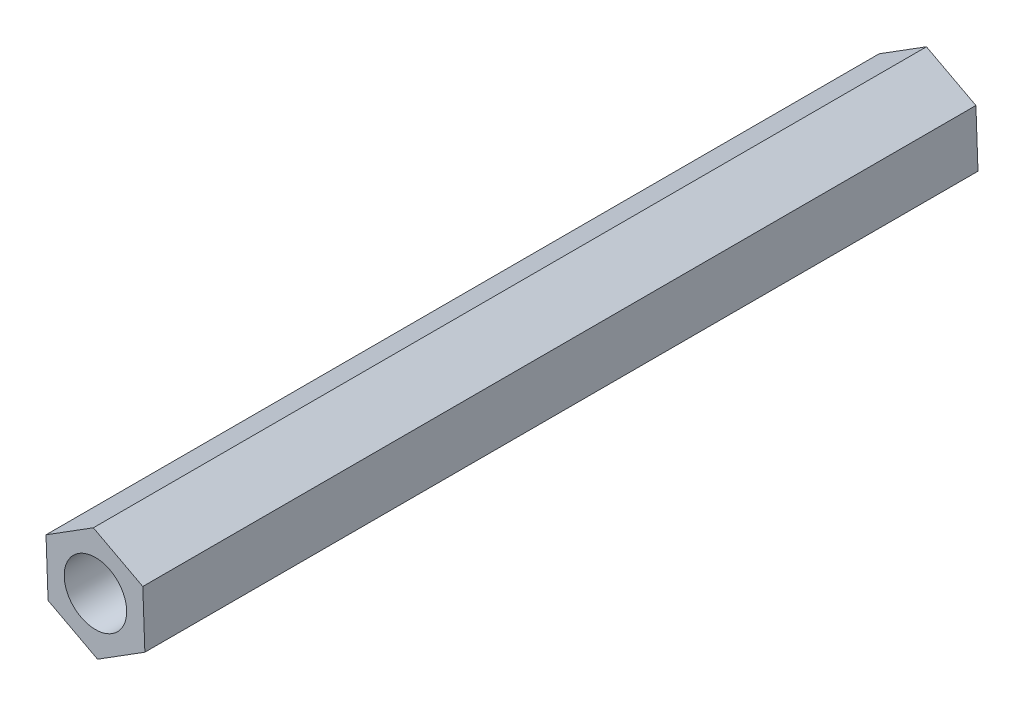
ISO-10303-21;
HEADER;
FILE_DESCRIPTION(('STEP AP214'),'2;1');
FILE_NAME('part.step','',(''),(''),'','','');
FILE_SCHEMA(('AUTOMOTIVE_DESIGN { 1 0 10303 214 1 1 1 1 }'));
ENDSEC;
DATA;
#1=APPLICATION_CONTEXT('core data for automotive mechanical design processes');
#2=APPLICATION_PROTOCOL_DEFINITION('international standard','automotive_design',2000,#1);
#3=PRODUCT_CONTEXT('',#1,'mechanical');
#4=PRODUCT('Part','Part','',(#3));
#5=PRODUCT_RELATED_PRODUCT_CATEGORY('part','',(#4));
#6=PRODUCT_DEFINITION_FORMATION('','',#4);
#7=PRODUCT_DEFINITION_CONTEXT('part definition',#1,'design');
#8=PRODUCT_DEFINITION('design','',#6,#7);
#9=PRODUCT_DEFINITION_SHAPE('','',#8);
#10=(LENGTH_UNIT() NAMED_UNIT(*) SI_UNIT(.MILLI.,.METRE.));
#11=(NAMED_UNIT(*) PLANE_ANGLE_UNIT() SI_UNIT($,.RADIAN.));
#12=(NAMED_UNIT(*) SI_UNIT($,.STERADIAN.) SOLID_ANGLE_UNIT());
#13=UNCERTAINTY_MEASURE_WITH_UNIT(LENGTH_MEASURE(1.E-05),#10,'distance_accuracy_value','');
#14=(GEOMETRIC_REPRESENTATION_CONTEXT(3) GLOBAL_UNCERTAINTY_ASSIGNED_CONTEXT((#13)) GLOBAL_UNIT_ASSIGNED_CONTEXT((#10,
#11,#12)) REPRESENTATION_CONTEXT('',''));
#15=CARTESIAN_POINT('',(0.,0.,0.));
#16=DIRECTION('',(0.,0.,1.));
#17=DIRECTION('',(1.,0.,0.));
#18=AXIS2_PLACEMENT_3D('',#15,#16,#17);
#19=CARTESIAN_POINT('',(0.,0.,40.));
#20=DIRECTION('',(0.,0.,1.));
#21=DIRECTION('',(1.,0.,0.));
#22=AXIS2_PLACEMENT_3D('',#19,#20,#21);
#23=PLANE('',#22);
#24=DIRECTION('',(-0.0373746720524852,0.999301322869618,0.));
#25=VECTOR('',#24,1.);
#26=CARTESIAN_POINT('',(2.37354506962798,-1.25450540152072,40.));
#27=LINE('',#26,#25);
#28=CARTESIAN_POINT('',(2.37354506962798,-1.25450540152072,40.));
#29=VERTEX_POINT('',#28);
#30=CARTESIAN_POINT('',(2.27320608171573,1.42829762656477,40.));
#31=VERTEX_POINT('',#30);
#32=EDGE_CURVE('E131',#29,#31,#27,.T.);
#33=ORIENTED_EDGE('',*,*,#32,.T.);
#34=DIRECTION('',(-0.884107667666727,0.467283245979245,0.));
#35=VECTOR('',#34,1.);
#36=CARTESIAN_POINT('',(2.27320608171573,1.42829762656477,40.));
#37=LINE('',#36,#35);
#38=CARTESIAN_POINT('',(-0.100338987912251,2.68280302808549,40.));
#39=VERTEX_POINT('',#38);
#40=EDGE_CURVE('E89',#31,#39,#37,.T.);
#41=ORIENTED_EDGE('',*,*,#40,.T.);
#42=DIRECTION('',(-0.846732995614242,-0.532018076890375,0.));
#43=VECTOR('',#42,1.);
#44=CARTESIAN_POINT('',(-0.100338987912251,2.68280302808549,40.));
#45=LINE('',#44,#43);
#46=CARTESIAN_POINT('',(-2.37354506962798,1.25450540152072,40.));
#47=VERTEX_POINT('',#46);
#48=EDGE_CURVE('E102',#39,#47,#45,.T.);
#49=ORIENTED_EDGE('',*,*,#48,.T.);
#50=DIRECTION('',(0.0373746720524864,-0.999301322869618,0.));
#51=VECTOR('',#50,1.);
#52=CARTESIAN_POINT('',(-2.37354506962798,1.25450540152072,40.));
#53=LINE('',#52,#51);
#54=CARTESIAN_POINT('',(-2.27320608171573,-1.42829762656478,40.));
#55=VERTEX_POINT('',#54);
#56=EDGE_CURVE('E96',#47,#55,#53,.T.);
#57=ORIENTED_EDGE('',*,*,#56,.T.);
#58=DIRECTION('',(0.884107667666728,-0.467283245979244,0.));
#59=VECTOR('',#58,1.);
#60=CARTESIAN_POINT('',(-2.27320608171573,-1.42829762656478,40.));
#61=LINE('',#60,#59);
#62=CARTESIAN_POINT('',(0.100338987912251,-2.68280302808549,40.));
#63=VERTEX_POINT('',#62);
#64=EDGE_CURVE('E100',#55,#63,#61,.T.);
#65=ORIENTED_EDGE('',*,*,#64,.T.);
#66=DIRECTION('',(0.846732995614242,0.532018076890374,0.));
#67=VECTOR('',#66,1.);
#68=CARTESIAN_POINT('',(0.100338987912251,-2.68280302808549,40.));
#69=LINE('',#68,#67);
#70=EDGE_CURVE('E52',#63,#29,#69,.T.);
#71=ORIENTED_EDGE('',*,*,#70,.T.);
#72=EDGE_LOOP('',(#33,#41,#49,#57,#65,#71));
#73=FACE_BOUND('',#72,.T.);
#74=CARTESIAN_POINT('',(0.,0.,40.));
#75=DIRECTION('',(0.,0.,1.));
#76=DIRECTION('',(1.,0.,0.));
#77=AXIS2_PLACEMENT_3D('',#74,#75,#76);
#78=CIRCLE('',#77,1.5);
#79=CARTESIAN_POINT('',(1.5,0.,40.));
#80=VERTEX_POINT('',#79);
#81=EDGE_CURVE('E124',#80,#80,#78,.T.);
#82=ORIENTED_EDGE('',*,*,#81,.F.);
#83=EDGE_LOOP('',(#82));
#84=FACE_BOUND('',#83,.T.);
#85=ADVANCED_FACE('F35',(#73,#84),#23,.T.);
#86=CARTESIAN_POINT('',(0.,0.,0.));
#87=DIRECTION('',(0.,0.,1.));
#88=DIRECTION('',(1.,0.,0.));
#89=AXIS2_PLACEMENT_3D('',#86,#87,#88);
#90=PLANE('',#89);
#91=DIRECTION('',(-0.0373746720524852,0.999301322869618,0.));
#92=VECTOR('',#91,1.);
#93=CARTESIAN_POINT('',(2.37354506962798,-1.25450540152072,0.));
#94=LINE('',#93,#92);
#95=CARTESIAN_POINT('',(2.37354506962798,-1.25450540152072,0.));
#96=VERTEX_POINT('',#95);
#97=CARTESIAN_POINT('',(2.27320608171573,1.42829762656477,0.));
#98=VERTEX_POINT('',#97);
#99=EDGE_CURVE('E120',#96,#98,#94,.T.);
#100=ORIENTED_EDGE('',*,*,#99,.F.);
#101=DIRECTION('',(0.846732995614242,0.532018076890374,0.));
#102=VECTOR('',#101,1.);
#103=CARTESIAN_POINT('',(0.100338987912251,-2.68280302808549,0.));
#104=LINE('',#103,#102);
#105=CARTESIAN_POINT('',(0.100338987912251,-2.68280302808549,0.));
#106=VERTEX_POINT('',#105);
#107=EDGE_CURVE('E81',#106,#96,#104,.T.);
#108=ORIENTED_EDGE('',*,*,#107,.F.);
#109=DIRECTION('',(0.884107667666728,-0.467283245979244,0.));
#110=VECTOR('',#109,1.);
#111=CARTESIAN_POINT('',(-2.27320608171573,-1.42829762656478,0.));
#112=LINE('',#111,#110);
#113=CARTESIAN_POINT('',(-2.27320608171573,-1.42829762656478,0.));
#114=VERTEX_POINT('',#113);
#115=EDGE_CURVE('E75',#114,#106,#112,.T.);
#116=ORIENTED_EDGE('',*,*,#115,.F.);
#117=DIRECTION('',(0.0373746720524864,-0.999301322869618,0.));
#118=VECTOR('',#117,1.);
#119=CARTESIAN_POINT('',(-2.37354506962798,1.25450540152072,0.));
#120=LINE('',#119,#118);
#121=CARTESIAN_POINT('',(-2.37354506962798,1.25450540152072,0.));
#122=VERTEX_POINT('',#121);
#123=EDGE_CURVE('E110',#122,#114,#120,.T.);
#124=ORIENTED_EDGE('',*,*,#123,.F.);
#125=DIRECTION('',(-0.846732995614242,-0.532018076890375,0.));
#126=VECTOR('',#125,1.);
#127=CARTESIAN_POINT('',(-0.100338987912251,2.68280302808549,0.));
#128=LINE('',#127,#126);
#129=CARTESIAN_POINT('',(-0.100338987912251,2.68280302808549,0.));
#130=VERTEX_POINT('',#129);
#131=EDGE_CURVE('E126',#130,#122,#128,.T.);
#132=ORIENTED_EDGE('',*,*,#131,.F.);
#133=DIRECTION('',(-0.884107667666727,0.467283245979245,0.));
#134=VECTOR('',#133,1.);
#135=CARTESIAN_POINT('',(2.27320608171573,1.42829762656477,0.));
#136=LINE('',#135,#134);
#137=EDGE_CURVE('E123',#98,#130,#136,.T.);
#138=ORIENTED_EDGE('',*,*,#137,.F.);
#139=EDGE_LOOP('',(#100,#108,#116,#124,#132,#138));
#140=FACE_BOUND('',#139,.T.);
#141=CARTESIAN_POINT('',(0.,0.,0.));
#142=DIRECTION('',(0.,0.,1.));
#143=DIRECTION('',(1.,0.,0.));
#144=AXIS2_PLACEMENT_3D('',#141,#142,#143);
#145=CIRCLE('',#144,1.5);
#146=CARTESIAN_POINT('',(1.5,0.,0.));
#147=VERTEX_POINT('',#146);
#148=EDGE_CURVE('E224',#147,#147,#145,.T.);
#149=ORIENTED_EDGE('',*,*,#148,.T.);
#150=EDGE_LOOP('',(#149));
#151=FACE_BOUND('',#150,.T.);
#152=ADVANCED_FACE('F140',(#140,#151),#90,.F.);
#153=CARTESIAN_POINT('',(2.37354506962798,-1.25450540152072,40.));
#154=DIRECTION('',(-0.999301322869618,-0.0373746720524852,0.));
#155=DIRECTION('',(0.0373746720524852,-0.999301322869618,0.));
#156=AXIS2_PLACEMENT_3D('',#153,#154,#155);
#157=PLANE('',#156);
#158=ORIENTED_EDGE('',*,*,#99,.T.);
#159=DIRECTION('',(0.,0.,-1.));
#160=VECTOR('',#159,1.);
#161=CARTESIAN_POINT('',(2.27320608171573,1.42829762656477,40.));
#162=LINE('',#161,#160);
#163=EDGE_CURVE('E11',#31,#98,#162,.T.);
#164=ORIENTED_EDGE('',*,*,#163,.F.);
#165=ORIENTED_EDGE('',*,*,#32,.F.);
#166=DIRECTION('',(0.,0.,-1.));
#167=VECTOR('',#166,1.);
#168=CARTESIAN_POINT('',(2.37354506962798,-1.25450540152072,40.));
#169=LINE('',#168,#167);
#170=EDGE_CURVE('E116',#29,#96,#169,.T.);
#171=ORIENTED_EDGE('',*,*,#170,.T.);
#172=EDGE_LOOP('',(#158,#164,#165,#171));
#173=FACE_BOUND('',#172,.T.);
#174=ADVANCED_FACE('F37',(#173),#157,.F.);
#175=CARTESIAN_POINT('',(2.27320608171573,1.42829762656477,40.));
#176=DIRECTION('',(-0.467283245979245,-0.884107667666727,0.));
#177=DIRECTION('',(0.884107667666727,-0.467283245979245,0.));
#178=AXIS2_PLACEMENT_3D('',#175,#176,#177);
#179=PLANE('',#178);
#180=ORIENTED_EDGE('',*,*,#137,.T.);
#181=DIRECTION('',(0.,0.,-1.));
#182=VECTOR('',#181,1.);
#183=CARTESIAN_POINT('',(-0.100338987912251,2.68280302808549,40.));
#184=LINE('',#183,#182);
#185=EDGE_CURVE('E44',#39,#130,#184,.T.);
#186=ORIENTED_EDGE('',*,*,#185,.F.);
#187=ORIENTED_EDGE('',*,*,#40,.F.);
#188=ORIENTED_EDGE('',*,*,#163,.T.);
#189=EDGE_LOOP('',(#180,#186,#187,#188));
#190=FACE_BOUND('',#189,.T.);
#191=ADVANCED_FACE('F165',(#190),#179,.F.);
#192=CARTESIAN_POINT('',(-0.100338987912251,2.68280302808549,40.));
#193=DIRECTION('',(0.532018076890375,-0.846732995614242,0.));
#194=DIRECTION('',(0.846732995614242,0.532018076890375,0.));
#195=AXIS2_PLACEMENT_3D('',#192,#193,#194);
#196=PLANE('',#195);
#197=ORIENTED_EDGE('',*,*,#131,.T.);
#198=DIRECTION('',(0.,0.,-1.));
#199=VECTOR('',#198,1.);
#200=CARTESIAN_POINT('',(-2.37354506962798,1.25450540152072,40.));
#201=LINE('',#200,#199);
#202=EDGE_CURVE('E111',#47,#122,#201,.T.);
#203=ORIENTED_EDGE('',*,*,#202,.F.);
#204=ORIENTED_EDGE('',*,*,#48,.F.);
#205=ORIENTED_EDGE('',*,*,#185,.T.);
#206=EDGE_LOOP('',(#197,#203,#204,#205));
#207=FACE_BOUND('',#206,.T.);
#208=ADVANCED_FACE('F137',(#207),#196,.F.);
#209=CARTESIAN_POINT('',(-2.37354506962798,1.25450540152072,40.));
#210=DIRECTION('',(0.999301322869618,0.0373746720524864,0.));
#211=DIRECTION('',(-0.0373746720524864,0.999301322869618,0.));
#212=AXIS2_PLACEMENT_3D('',#209,#210,#211);
#213=PLANE('',#212);
#214=ORIENTED_EDGE('',*,*,#123,.T.);
#215=DIRECTION('',(0.,0.,-1.));
#216=VECTOR('',#215,1.);
#217=CARTESIAN_POINT('',(-2.27320608171573,-1.42829762656478,40.));
#218=LINE('',#217,#216);
#219=EDGE_CURVE('E107',#55,#114,#218,.T.);
#220=ORIENTED_EDGE('',*,*,#219,.F.);
#221=ORIENTED_EDGE('',*,*,#56,.F.);
#222=ORIENTED_EDGE('',*,*,#202,.T.);
#223=EDGE_LOOP('',(#214,#220,#221,#222));
#224=FACE_BOUND('',#223,.T.);
#225=ADVANCED_FACE('F108',(#224),#213,.F.);
#226=CARTESIAN_POINT('',(-2.27320608171573,-1.42829762656478,40.));
#227=DIRECTION('',(0.467283245979244,0.884107667666728,0.));
#228=DIRECTION('',(-0.884107667666728,0.467283245979244,0.));
#229=AXIS2_PLACEMENT_3D('',#226,#227,#228);
#230=PLANE('',#229);
#231=ORIENTED_EDGE('',*,*,#115,.T.);
#232=DIRECTION('',(0.,0.,-1.));
#233=VECTOR('',#232,1.);
#234=CARTESIAN_POINT('',(0.100338987912251,-2.68280302808549,40.));
#235=LINE('',#234,#233);
#236=EDGE_CURVE('E112',#63,#106,#235,.T.);
#237=ORIENTED_EDGE('',*,*,#236,.F.);
#238=ORIENTED_EDGE('',*,*,#64,.F.);
#239=ORIENTED_EDGE('',*,*,#219,.T.);
#240=EDGE_LOOP('',(#231,#237,#238,#239));
#241=FACE_BOUND('',#240,.T.);
#242=ADVANCED_FACE('F114',(#241),#230,.F.);
#243=CARTESIAN_POINT('',(0.100338987912251,-2.68280302808549,40.));
#244=DIRECTION('',(-0.532018076890374,0.846732995614242,0.));
#245=DIRECTION('',(-0.846732995614242,-0.532018076890375,0.));
#246=AXIS2_PLACEMENT_3D('',#243,#244,#245);
#247=PLANE('',#246);
#248=ORIENTED_EDGE('',*,*,#107,.T.);
#249=ORIENTED_EDGE('',*,*,#170,.F.);
#250=ORIENTED_EDGE('',*,*,#70,.F.);
#251=ORIENTED_EDGE('',*,*,#236,.T.);
#252=EDGE_LOOP('',(#248,#249,#250,#251));
#253=FACE_BOUND('',#252,.T.);
#254=ADVANCED_FACE('F145',(#253),#247,.F.);
#255=CARTESIAN_POINT('',(0.,0.,40.));
#256=DIRECTION('',(0.,0.,-1.));
#257=DIRECTION('',(-1.,0.,0.));
#258=AXIS2_PLACEMENT_3D('',#255,#256,#257);
#259=CYLINDRICAL_SURFACE('',#258,1.5);
#260=ORIENTED_EDGE('',*,*,#81,.T.);
#261=EDGE_LOOP('',(#260));
#262=FACE_BOUND('',#261,.T.);
#263=ORIENTED_EDGE('',*,*,#148,.F.);
#264=EDGE_LOOP('',(#263));
#265=FACE_BOUND('',#264,.T.);
#266=ADVANCED_FACE('F147',(#262,#265),#259,.F.);
#267=CLOSED_SHELL('',(#85,#152,#174,#191,#208,#225,#242,#254,#266));
#268=MANIFOLD_SOLID_BREP('B2',#267);
#269=ADVANCED_BREP_SHAPE_REPRESENTATION('',(#18,#268),#14);
#270=SHAPE_DEFINITION_REPRESENTATION(#9,#269);
ENDSEC;
END-ISO-10303-21;
